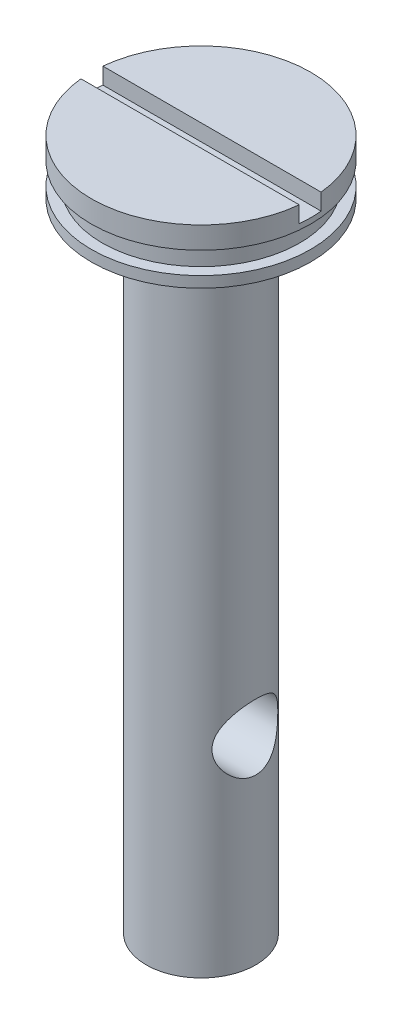
ISO-10303-21;
HEADER;
FILE_DESCRIPTION(('STEP AP214'),'2;1');
FILE_NAME('part.step','',(''),(''),'','','');
FILE_SCHEMA(('AUTOMOTIVE_DESIGN { 1 0 10303 214 1 1 1 1 }'));
ENDSEC;
DATA;
#1=APPLICATION_CONTEXT('core data for automotive mechanical design processes');
#2=APPLICATION_PROTOCOL_DEFINITION('international standard','automotive_design',2000,#1);
#3=PRODUCT_CONTEXT('',#1,'mechanical');
#4=PRODUCT('Part','Part','',(#3));
#5=PRODUCT_RELATED_PRODUCT_CATEGORY('part','',(#4));
#6=PRODUCT_DEFINITION_FORMATION('','',#4);
#7=PRODUCT_DEFINITION_CONTEXT('part definition',#1,'design');
#8=PRODUCT_DEFINITION('design','',#6,#7);
#9=PRODUCT_DEFINITION_SHAPE('','',#8);
#10=(LENGTH_UNIT() NAMED_UNIT(*) SI_UNIT(.MILLI.,.METRE.));
#11=(NAMED_UNIT(*) PLANE_ANGLE_UNIT() SI_UNIT($,.RADIAN.));
#12=(NAMED_UNIT(*) SI_UNIT($,.STERADIAN.) SOLID_ANGLE_UNIT());
#13=UNCERTAINTY_MEASURE_WITH_UNIT(LENGTH_MEASURE(1.E-05),#10,'distance_accuracy_value','');
#14=(GEOMETRIC_REPRESENTATION_CONTEXT(3) GLOBAL_UNCERTAINTY_ASSIGNED_CONTEXT((#13)) GLOBAL_UNIT_ASSIGNED_CONTEXT((#10,
#11,#12)) REPRESENTATION_CONTEXT('',''));
#15=CARTESIAN_POINT('',(0.,0.,0.));
#16=DIRECTION('',(0.,0.,1.));
#17=DIRECTION('',(1.,0.,0.));
#18=AXIS2_PLACEMENT_3D('',#15,#16,#17);
#19=CARTESIAN_POINT('',(0.,45.,-10.));
#20=DIRECTION('',(0.,-1.,0.));
#21=DIRECTION('',(0.,0.,-1.));
#22=AXIS2_PLACEMENT_3D('',#19,#20,#21);
#23=PLANE('',#22);
#24=CARTESIAN_POINT('',(0.,45.,0.));
#25=DIRECTION('',(0.,1.,0.));
#26=DIRECTION('',(0.,0.,1.));
#27=AXIS2_PLACEMENT_3D('',#24,#25,#26);
#28=CIRCLE('',#27,10.);
#29=CARTESIAN_POINT('',(-9.94987437106621,45.,1.));
#30=VERTEX_POINT('',#29);
#31=CARTESIAN_POINT('',(9.94987437106621,45.,1.));
#32=VERTEX_POINT('',#31);
#33=EDGE_CURVE('E101',#30,#32,#28,.T.);
#34=ORIENTED_EDGE('',*,*,#33,.T.);
#35=DIRECTION('',(-1.,0.,0.));
#36=VECTOR('',#35,1.);
#37=CARTESIAN_POINT('',(0.,45.,0.999999999999999));
#38=LINE('',#37,#36);
#39=EDGE_CURVE('E66',#32,#30,#38,.T.);
#40=ORIENTED_EDGE('',*,*,#39,.T.);
#41=EDGE_LOOP('',(#34,#40));
#42=FACE_BOUND('',#41,.T.);
#43=ADVANCED_FACE('F37',(#42),#23,.F.);
#44=CARTESIAN_POINT('',(0.,43.,-10.));
#45=DIRECTION('',(0.,1.,0.));
#46=DIRECTION('',(0.,0.,1.));
#47=AXIS2_PLACEMENT_3D('',#44,#45,#46);
#48=PLANE('',#47);
#49=CARTESIAN_POINT('',(0.,43.,0.));
#50=DIRECTION('',(0.,1.,0.));
#51=DIRECTION('',(0.,0.,1.));
#52=AXIS2_PLACEMENT_3D('',#49,#50,#51);
#53=CIRCLE('',#52,10.);
#54=CARTESIAN_POINT('',(0.,43.,10.));
#55=VERTEX_POINT('',#54);
#56=EDGE_CURVE('E90',#55,#55,#53,.T.);
#57=ORIENTED_EDGE('',*,*,#56,.F.);
#58=EDGE_LOOP('',(#57));
#59=FACE_BOUND('',#58,.T.);
#60=CARTESIAN_POINT('',(0.,43.,0.));
#61=DIRECTION('',(0.,1.,0.));
#62=DIRECTION('',(0.,0.,1.));
#63=AXIS2_PLACEMENT_3D('',#60,#61,#62);
#64=CIRCLE('',#63,9.00000000000003);
#65=CARTESIAN_POINT('',(0.,43.,9.00000000000004));
#66=VERTEX_POINT('',#65);
#67=EDGE_CURVE('E267',#66,#66,#64,.T.);
#68=ORIENTED_EDGE('',*,*,#67,.T.);
#69=EDGE_LOOP('',(#68));
#70=FACE_BOUND('',#69,.T.);
#71=ADVANCED_FACE('F39',(#59,#70),#48,.F.);
#72=CARTESIAN_POINT('',(0.,-18.,0.));
#73=DIRECTION('',(0.,1.,0.));
#74=DIRECTION('',(0.,0.,1.));
#75=AXIS2_PLACEMENT_3D('',#72,#73,#74);
#76=CYLINDRICAL_SURFACE('',#75,10.);
#77=CARTESIAN_POINT('',(9.94987437106621,45.,-0.999999999999999));
#78=VERTEX_POINT('',#77);
#79=CARTESIAN_POINT('',(-9.94987437106621,45.,-1.));
#80=VERTEX_POINT('',#79);
#81=EDGE_CURVE('E96',#78,#80,#28,.T.);
#82=ORIENTED_EDGE('',*,*,#81,.F.);
#83=DIRECTION('',(0.,1.,0.));
#84=VECTOR('',#83,1.);
#85=CARTESIAN_POINT('',(9.94987437106622,-18.,-1.00000000000001));
#86=LINE('',#85,#84);
#87=CARTESIAN_POINT('',(9.94987437106622,43.5,-1.));
#88=VERTEX_POINT('',#87);
#89=EDGE_CURVE('E58',#78,#88,#86,.F.);
#90=ORIENTED_EDGE('',*,*,#89,.T.);
#91=CARTESIAN_POINT('',(0.,43.5,0.));
#92=DIRECTION('',(0.,-1.,0.));
#93=DIRECTION('',(0.,0.,-1.));
#94=AXIS2_PLACEMENT_3D('',#91,#92,#93);
#95=CIRCLE('',#94,10.);
#96=CARTESIAN_POINT('',(9.94987437106622,43.5,1.));
#97=VERTEX_POINT('',#96);
#98=EDGE_CURVE('E111',#88,#97,#95,.T.);
#99=ORIENTED_EDGE('',*,*,#98,.T.);
#100=DIRECTION('',(0.,1.,0.));
#101=VECTOR('',#100,1.);
#102=CARTESIAN_POINT('',(9.94987437106622,-18.,1.00000000000001));
#103=LINE('',#102,#101);
#104=EDGE_CURVE('E270',#97,#32,#103,.T.);
#105=ORIENTED_EDGE('',*,*,#104,.T.);
#106=ORIENTED_EDGE('',*,*,#33,.F.);
#107=DIRECTION('',(0.,1.,0.));
#108=VECTOR('',#107,1.);
#109=CARTESIAN_POINT('',(-9.94987437106622,-18.,1.00000000000001));
#110=LINE('',#109,#108);
#111=CARTESIAN_POINT('',(-9.94987437106622,43.5,1.));
#112=VERTEX_POINT('',#111);
#113=EDGE_CURVE('E98',#30,#112,#110,.F.);
#114=ORIENTED_EDGE('',*,*,#113,.T.);
#115=CARTESIAN_POINT('',(-9.94987437106622,43.5,-1.));
#116=VERTEX_POINT('',#115);
#117=EDGE_CURVE('E51',#112,#116,#95,.T.);
#118=ORIENTED_EDGE('',*,*,#117,.T.);
#119=DIRECTION('',(0.,1.,0.));
#120=VECTOR('',#119,1.);
#121=CARTESIAN_POINT('',(-9.94987437106622,-18.,-1.00000000000001));
#122=LINE('',#121,#120);
#123=EDGE_CURVE('E85',#116,#80,#122,.T.);
#124=ORIENTED_EDGE('',*,*,#123,.T.);
#125=EDGE_LOOP('',(#82,#90,#99,#105,#106,#114,#118,#124));
#126=FACE_BOUND('',#125,.T.);
#127=ORIENTED_EDGE('',*,*,#56,.T.);
#128=EDGE_LOOP('',(#127));
#129=FACE_BOUND('',#128,.T.);
#130=ADVANCED_FACE('F94',(#126,#129),#76,.T.);
#131=ORIENTED_EDGE('',*,*,#81,.T.);
#132=DIRECTION('',(1.,0.,0.));
#133=VECTOR('',#132,1.);
#134=CARTESIAN_POINT('',(0.,45.,-0.999999999999999));
#135=LINE('',#134,#133);
#136=EDGE_CURVE('E82',#80,#78,#135,.T.);
#137=ORIENTED_EDGE('',*,*,#136,.T.);
#138=EDGE_LOOP('',(#131,#137));
#139=FACE_BOUND('',#138,.T.);
#140=ADVANCED_FACE('F100',(#139),#23,.F.);
#141=CARTESIAN_POINT('',(0.,-18.,0.));
#142=DIRECTION('',(0.,1.,0.));
#143=DIRECTION('',(0.,0.,1.));
#144=AXIS2_PLACEMENT_3D('',#141,#142,#143);
#145=PLANE('',#144);
#146=CARTESIAN_POINT('',(0.,-18.,0.));
#147=DIRECTION('',(0.,1.,0.));
#148=DIRECTION('',(0.,0.,1.));
#149=AXIS2_PLACEMENT_3D('',#146,#147,#148);
#150=CIRCLE('',#149,5.);
#151=CARTESIAN_POINT('',(0.,-18.,4.99999999999999));
#152=VERTEX_POINT('',#151);
#153=EDGE_CURVE('E106',#152,#152,#150,.T.);
#154=ORIENTED_EDGE('',*,*,#153,.F.);
#155=EDGE_LOOP('',(#154));
#156=FACE_BOUND('',#155,.T.);
#157=ADVANCED_FACE('F152',(#156),#145,.F.);
#158=CARTESIAN_POINT('',(0.,-18.,0.));
#159=DIRECTION('',(0.,1.,0.));
#160=DIRECTION('',(0.,0.,1.));
#161=AXIS2_PLACEMENT_3D('',#158,#159,#160);
#162=CYLINDRICAL_SURFACE('',#161,5.00000000000001);
#163=CARTESIAN_POINT('',(-4.00000000000001,0.,-3.));
#164=CARTESIAN_POINT('',(-3.99999997094659,0.0754616103656618,-2.9999999059924));
#165=CARTESIAN_POINT('',(-4.00214560778387,0.150919951825707,-2.99714660074499));
#166=CARTESIAN_POINT('',(-4.0106190584126,0.301183579155877,-2.98579602023829));
#167=CARTESIAN_POINT('',(-4.01694847458099,0.37598860368072,-2.97729658251829));
#168=CARTESIAN_POINT('',(-4.04185988554315,0.598542400800125,-2.94350195877));
#169=CARTESIAN_POINT('',(-4.06636523363868,0.744466163038649,-2.90991036792577));
#170=CARTESIAN_POINT('',(-4.12724466313281,1.02619529387303,-2.82286888064331));
#171=CARTESIAN_POINT('',(-4.16353284212728,1.16206540972156,-2.76956233581238));
#172=CARTESIAN_POINT('',(-4.24371857831164,1.42286717142596,-2.64505893939301));
#173=CARTESIAN_POINT('',(-4.28761840405595,1.54779553947816,-2.57385675138361));
#174=CARTESIAN_POINT('',(-4.38457211439751,1.79990131024536,-2.40542341931062));
#175=CARTESIAN_POINT('',(-4.43808896832274,1.92548608074574,-2.30607419983945));
#176=CARTESIAN_POINT('',(-4.54452303763809,2.15952535636891,-2.08854542159202));
#177=CARTESIAN_POINT('',(-4.5974397715576,2.26796690142325,-1.97035175093534));
#178=CARTESIAN_POINT('',(-4.7035179816543,2.47628246871424,-1.70284578042266));
#179=CARTESIAN_POINT('',(-4.75608869625049,2.57396641364106,-1.55155129309905));
#180=CARTESIAN_POINT('',(-4.82570563669469,2.69974650858797,-1.31132430439157));
#181=CARTESIAN_POINT('',(-4.84737661360988,2.73822411545811,-1.22900736782604));
#182=CARTESIAN_POINT('',(-4.8870100275605,2.80779096487914,-1.06047221299631));
#183=CARTESIAN_POINT('',(-4.90497491519087,2.83888509171157,-0.974256618946845));
#184=CARTESIAN_POINT('',(-4.93511193886541,2.89062746245329,-0.806968026671436));
#185=CARTESIAN_POINT('',(-4.94767216447127,2.9119872715291,-0.726184158740188));
#186=CARTESIAN_POINT('',(-4.96892323787742,2.94794996135096,-0.562666348744431));
#187=CARTESIAN_POINT('',(-4.97761624192488,2.9625566076376,-0.479933520527564));
#188=CARTESIAN_POINT('',(-4.99087754875313,2.98478468451609,-0.313244621267395));
#189=CARTESIAN_POINT('',(-4.99544805239182,2.9924098423118,-0.229289227265367));
#190=CARTESIAN_POINT('',(-5.00033941607429,3.00056663984718,-0.0609397888852066));
#191=CARTESIAN_POINT('',(-5.00066070848408,3.00109900129356,0.0234542099897582));
#192=CARTESIAN_POINT('',(-4.99565270087358,2.99275721772025,0.255171183646356));
#193=CARTESIAN_POINT('',(-4.98590479614143,2.97652885035085,0.402219957267168));
#194=CARTESIAN_POINT('',(-4.95416390550292,2.92304450631758,0.690956248818425));
#195=CARTESIAN_POINT('',(-4.93217001333341,2.88578697338949,0.832643369131342));
#196=CARTESIAN_POINT('',(-4.87769707511976,2.79166776699804,1.10810607069191));
#197=CARTESIAN_POINT('',(-4.84515792140776,2.73469357980007,1.2418309672266));
#198=CARTESIAN_POINT('',(-4.77219304045847,2.6032310655483,1.49797933560354));
#199=CARTESIAN_POINT('',(-4.73176526544936,2.52873818986414,1.62039986081242));
#200=CARTESIAN_POINT('',(-4.64075842839174,2.35432172038148,1.86614789799246));
#201=CARTESIAN_POINT('',(-4.58954363323804,2.25242335146449,1.98783715480756));
#202=CARTESIAN_POINT('',(-4.48511110796776,2.03119178989514,2.21342948923169));
#203=CARTESIAN_POINT('',(-4.43189074054161,1.91183500028094,2.31730807434112));
#204=CARTESIAN_POINT('',(-4.3222214952534,1.64269317960225,2.51649670159325));
#205=CARTESIAN_POINT('',(-4.26611322583748,1.4909848446704,2.60941864927586));
#206=CARTESIAN_POINT('',(-4.16501759300693,1.17058753897333,2.76794435835451));
#207=CARTESIAN_POINT('',(-4.12000980621704,1.00193056868575,2.83359844351372));
#208=CARTESIAN_POINT('',(-4.05791730375362,0.695212735504367,2.92154993808435));
#209=CARTESIAN_POINT('',(-4.0366777727856,0.559918734207663,2.95055806318484));
#210=CARTESIAN_POINT('',(-4.00784301513239,0.285252780598733,2.98961745817055));
#211=CARTESIAN_POINT('',(-4.00023192044757,0.145885763115489,2.99969077510549));
#212=CARTESIAN_POINT('',(-3.99977828828381,-0.133103368961641,3.00029561322377));
#213=CARTESIAN_POINT('',(-4.00695621149425,-0.272725569601723,2.99080006076192));
#214=CARTESIAN_POINT('',(-4.03503040875295,-0.547974672313776,2.95280584471632));
#215=CARTESIAN_POINT('',(-4.05593752603306,-0.683598327819912,2.92429216045109));
#216=CARTESIAN_POINT('',(-4.10863539286052,-0.947429215549482,2.84976612867927));
#217=CARTESIAN_POINT('',(-4.14041253958233,-1.07564548413755,2.8037756438149));
#218=CARTESIAN_POINT('',(-4.21143069058875,-1.32295522030752,2.69592568264801));
#219=CARTESIAN_POINT('',(-4.25067450889247,-1.44204522459391,2.63406022035171));
#220=CARTESIAN_POINT('',(-4.34073681424695,-1.69048109524631,2.48334675803861));
#221=CARTESIAN_POINT('',(-4.3923665298154,-1.81780543232945,2.39164503852699));
#222=CARTESIAN_POINT('',(-4.49643335252965,-2.05656720394542,2.1897561409589));
#223=CARTESIAN_POINT('',(-4.54887118822614,-2.16798924609445,2.0795512745713));
#224=CARTESIAN_POINT('',(-4.65671991538656,-2.38646399131575,1.82651475528322));
#225=CARTESIAN_POINT('',(-4.71163080343123,-2.49106470576289,1.68130397020027));
#226=CARTESIAN_POINT('',(-4.78599458202113,-2.6281544977234,1.4494463127851));
#227=CARTESIAN_POINT('',(-4.80945640676868,-2.67056200213692,1.36978605711652));
#228=CARTESIAN_POINT('',(-4.85305400686527,-2.74830388347849,1.20623656162323));
#229=CARTESIAN_POINT('',(-4.8731918746406,-2.7836427131187,1.12235002598573));
#230=CARTESIAN_POINT('',(-4.90820667253682,-2.84447964323443,0.957140698774926));
#231=CARTESIAN_POINT('',(-4.92335831278732,-2.87050371846179,0.876069467337975));
#232=CARTESIAN_POINT('',(-4.94982497459133,-2.91566498160908,0.711460619981294));
#233=CARTESIAN_POINT('',(-4.9611421459459,-2.93480602887991,0.627924414708822));
#234=CARTESIAN_POINT('',(-4.97959903931251,-2.9659003097131,0.45911961508227));
#235=CARTESIAN_POINT('',(-4.98674160560363,-2.97785843736055,0.373852241304036));
#236=CARTESIAN_POINT('',(-4.99664216975595,-2.99440676165901,0.202384159163463));
#237=CARTESIAN_POINT('',(-4.99940073918633,-2.99899791878895,0.116183573945408));
#238=CARTESIAN_POINT('',(-5.00079353601934,-3.0013282897594,-0.11951938408059));
#239=CARTESIAN_POINT('',(-4.99493619757571,-2.9916010745741,-0.269213134971596));
#240=CARTESIAN_POINT('',(-4.97026391444785,-2.95021794585105,-0.564325544477565));
#241=CARTESIAN_POINT('',(-4.95144882543497,-2.91856178805991,-0.70974415545549));
#242=CARTESIAN_POINT('',(-4.90298726022977,-2.83555942935371,-0.990283617430286));
#243=CARTESIAN_POINT('',(-4.87351900635897,-2.784536560451,-1.12553205648681));
#244=CARTESIAN_POINT('',(-4.80606707983651,-2.66471905823651,-1.38556595318152));
#245=CARTESIAN_POINT('',(-4.76808149787885,-2.59592043965643,-1.51034905620297));
#246=CARTESIAN_POINT('',(-4.68186861678972,-2.43415009310424,-1.76052652812015));
#247=CARTESIAN_POINT('',(-4.63297714592577,-2.33936493647195,-1.88451663454097));
#248=CARTESIAN_POINT('',(-4.5320378935883,-2.1324915754345,-2.1157957778969));
#249=CARTESIAN_POINT('',(-4.47998665474643,-2.0203842023356,-2.22306604531464));
#250=CARTESIAN_POINT('',(-4.37056449731608,-1.76543895662125,-2.43181699852644));
#251=CARTESIAN_POINT('',(-4.31335603990194,-1.62050691551089,-2.53083841179815));
#252=CARTESIAN_POINT('',(-4.20752457767504,-1.31299042740472,-2.70314606061126));
#253=CARTESIAN_POINT('',(-4.15889711577768,-1.15041521580195,-2.77644567607669));
#254=CARTESIAN_POINT('',(-4.10004730463766,-0.903377447312356,-2.8619348491458));
#255=CARTESIAN_POINT('',(-4.08329508678221,-0.824341408702765,-2.88571236613333));
#256=CARTESIAN_POINT('',(-4.0539508765597,-0.663869558199829,-2.92679381745552));
#257=CARTESIAN_POINT('',(-4.04135625254713,-0.582435300012672,-2.94410184772356));
#258=CARTESIAN_POINT('',(-4.02094972226271,-0.417953449305939,-2.97191221271433));
#259=CARTESIAN_POINT('',(-4.0131302337705,-0.334908631628274,-2.98242533831514));
#260=CARTESIAN_POINT('',(-4.00265571377828,-0.167907783336384,-2.99646884485439));
#261=CARTESIAN_POINT('',(-4.00000003232226,-0.0839518687375932,-3.00000010458449));
#262=CARTESIAN_POINT('',(-4.00000000000001,0.,-3.));
#263=B_SPLINE_CURVE_WITH_KNOTS('',3,(#163,#164,#165,#166,#167,#168,#169,#170,#171,#172,#173,
#174,#175,#176,#177,#178,#179,#180,#181,#182,#183,#184,#185,#186,#187,#188,#189,#190,#191,#192,
#193,#194,#195,#196,#197,#198,#199,#200,#201,#202,#203,#204,#205,#206,#207,#208,#209,#210,#211,
#212,#213,#214,#215,#216,#217,#218,#219,#220,#221,#222,#223,#224,#225,#226,#227,#228,#229,#230,
#231,#232,#233,#234,#235,#236,#237,#238,#239,#240,#241,#242,#243,#244,#245,#246,#247,#248,#249,
#250,#251,#252,#253,#254,#255,#256,#257,#258,#259,#260,#261,#262),.UNSPECIFIED.,.T.,.F.,(4,2,2,
2,2,2,2,2,2,2,2,2,2,2,2,2,2,2,2,2,2,2,2,2,2,2,2,2,2,2,2,2,2,2,2,2,2,2,2,2,2,2,2,2,2,2,2,2,2,4),
(0.,0.226288173517879,0.452663065091107,0.905305714765856,1.35471981612576,1.80426809059901,
2.30878181396805,2.81367513819685,3.37309572088444,3.65297634398311,3.93267130287329,
4.18580566749444,4.43879871451846,4.6916566173785,4.94448879122708,5.38694235003539,
5.82942865693064,6.27448283989929,6.71965270654932,7.21799594026829,7.71701907227943,
8.27387316194678,8.82969494223662,9.24786570023494,9.66554925202079,10.0838110593649,
10.5024036052238,10.9204742264512,11.3387027222345,11.8323285087813,12.3264288987103,
12.884776299373,13.1641700331408,13.4433872125907,13.7024631857776,13.9613936663243,
14.2201475237758,14.4788676430947,14.9267946196281,15.3747265854331,15.8154875864153,
16.2563474905318,16.7450674536299,17.2343321574792,17.7856420979722,18.3366648323362,
18.5890061072372,18.8411873492279,19.0929671157917,19.3447151893881),.UNSPECIFIED.);
#264=CARTESIAN_POINT('',(-4.00000000000001,0.,-3.));
#265=VERTEX_POINT('',#264);
#266=EDGE_CURVE('E41',#265,#265,#263,.T.);
#267=ORIENTED_EDGE('',*,*,#266,.T.);
#268=EDGE_LOOP('',(#267));
#269=FACE_BOUND('',#268,.T.);
#270=CARTESIAN_POINT('',(4.00000000000002,0.,-3.));
#271=CARTESIAN_POINT('',(3.9999999709466,-0.0754616103656618,-2.99999990599239));
#272=CARTESIAN_POINT('',(4.00214560778387,-0.150919951825707,-2.99714660074499));
#273=CARTESIAN_POINT('',(4.0106190584126,-0.301183579155877,-2.98579602023829));
#274=CARTESIAN_POINT('',(4.01694847458099,-0.37598860368072,-2.97729658251829));
#275=CARTESIAN_POINT('',(4.04185988554315,-0.598542400800125,-2.94350195877));
#276=CARTESIAN_POINT('',(4.06636523363868,-0.744466163038649,-2.90991036792576));
#277=CARTESIAN_POINT('',(4.12724466313281,-1.02619529387303,-2.82286888064331));
#278=CARTESIAN_POINT('',(4.16353284212728,-1.16206540972156,-2.76956233581238));
#279=CARTESIAN_POINT('',(4.24371857831164,-1.42286717142596,-2.645058939393));
#280=CARTESIAN_POINT('',(4.28761840405595,-1.54779553947816,-2.5738567513836));
#281=CARTESIAN_POINT('',(4.38457211439752,-1.79990131024536,-2.40542341931062));
#282=CARTESIAN_POINT('',(4.43808896832274,-1.92548608074574,-2.30607419983945));
#283=CARTESIAN_POINT('',(4.54452303763809,-2.15952535636891,-2.08854542159202));
#284=CARTESIAN_POINT('',(4.5974397715576,-2.26796690142325,-1.97035175093534));
#285=CARTESIAN_POINT('',(4.7035179816543,-2.47628246871424,-1.70284578042266));
#286=CARTESIAN_POINT('',(4.75608869625049,-2.57396641364106,-1.55155129309905));
#287=CARTESIAN_POINT('',(4.82570563669469,-2.69974650858797,-1.31132430439156));
#288=CARTESIAN_POINT('',(4.84737661360988,-2.73822411545811,-1.22900736782604));
#289=CARTESIAN_POINT('',(4.8870100275605,-2.80779096487914,-1.06047221299631));
#290=CARTESIAN_POINT('',(4.90497491519087,-2.83888509171157,-0.974256618946842));
#291=CARTESIAN_POINT('',(4.93511193886541,-2.89062746245329,-0.806968026671433));
#292=CARTESIAN_POINT('',(4.94767216447127,-2.9119872715291,-0.726184158740185));
#293=CARTESIAN_POINT('',(4.96892323787742,-2.94794996135096,-0.562666348744428));
#294=CARTESIAN_POINT('',(4.97761624192488,-2.9625566076376,-0.479933520527561));
#295=CARTESIAN_POINT('',(4.99087754875313,-2.98478468451609,-0.313244621267392));
#296=CARTESIAN_POINT('',(4.99544805239182,-2.9924098423118,-0.229289227265364));
#297=CARTESIAN_POINT('',(5.00033941607429,-3.00056663984718,-0.0609397888852031));
#298=CARTESIAN_POINT('',(5.00066070848408,-3.00109900129356,0.0234542099897616));
#299=CARTESIAN_POINT('',(4.99565270087358,-2.99275721772025,0.25517118364636));
#300=CARTESIAN_POINT('',(4.98590479614143,-2.97652885035085,0.402219957267171));
#301=CARTESIAN_POINT('',(4.95416390550292,-2.92304450631758,0.690956248818428));
#302=CARTESIAN_POINT('',(4.93217001333341,-2.88578697338949,0.832643369131345));
#303=CARTESIAN_POINT('',(4.87769707511975,-2.79166776699804,1.10810607069191));
#304=CARTESIAN_POINT('',(4.84515792140776,-2.73469357980007,1.24183096722661));
#305=CARTESIAN_POINT('',(4.77219304045847,-2.6032310655483,1.49797933560354));
#306=CARTESIAN_POINT('',(4.73176526544936,-2.52873818986414,1.62039986081242));
#307=CARTESIAN_POINT('',(4.64075842839174,-2.35432172038148,1.86614789799246));
#308=CARTESIAN_POINT('',(4.58954363323804,-2.25242335146449,1.98783715480757));
#309=CARTESIAN_POINT('',(4.48511110796775,-2.03119178989514,2.2134294892317));
#310=CARTESIAN_POINT('',(4.43189074054161,-1.91183500028094,2.31730807434112));
#311=CARTESIAN_POINT('',(4.3222214952534,-1.64269317960225,2.51649670159325));
#312=CARTESIAN_POINT('',(4.26611322583747,-1.4909848446704,2.60941864927586));
#313=CARTESIAN_POINT('',(4.16501759300693,-1.17058753897333,2.76794435835452));
#314=CARTESIAN_POINT('',(4.12000980621703,-1.00193056868575,2.83359844351372));
#315=CARTESIAN_POINT('',(4.05791730375362,-0.695212735504366,2.92154993808435));
#316=CARTESIAN_POINT('',(4.0366777727856,-0.559918734207663,2.95055806318484));
#317=CARTESIAN_POINT('',(4.00784301513239,-0.285252780598733,2.98961745817055));
#318=CARTESIAN_POINT('',(4.00023192044757,-0.145885763115488,2.99969077510549));
#319=CARTESIAN_POINT('',(3.99977828828381,0.133103368961642,3.00029561322377));
#320=CARTESIAN_POINT('',(4.00695621149424,0.272725569601724,2.99080006076192));
#321=CARTESIAN_POINT('',(4.03503040875295,0.547974672313777,2.95280584471632));
#322=CARTESIAN_POINT('',(4.05593752603306,0.683598327819913,2.92429216045109));
#323=CARTESIAN_POINT('',(4.10863539286052,0.947429215549483,2.84976612867927));
#324=CARTESIAN_POINT('',(4.14041253958233,1.07564548413756,2.8037756438149));
#325=CARTESIAN_POINT('',(4.21143069058875,1.32295522030753,2.69592568264801));
#326=CARTESIAN_POINT('',(4.25067450889247,1.44204522459391,2.63406022035171));
#327=CARTESIAN_POINT('',(4.34073681424695,1.69048109524631,2.48334675803861));
#328=CARTESIAN_POINT('',(4.3923665298154,1.81780543232945,2.39164503852699));
#329=CARTESIAN_POINT('',(4.49643335252965,2.05656720394542,2.1897561409589));
#330=CARTESIAN_POINT('',(4.54887118822614,2.16798924609445,2.0795512745713));
#331=CARTESIAN_POINT('',(4.65671991538656,2.38646399131575,1.82651475528322));
#332=CARTESIAN_POINT('',(4.71163080343123,2.49106470576289,1.68130397020028));
#333=CARTESIAN_POINT('',(4.78599458202113,2.6281544977234,1.44944631278511));
#334=CARTESIAN_POINT('',(4.80945640676868,2.67056200213692,1.36978605711652));
#335=CARTESIAN_POINT('',(4.85305400686528,2.74830388347849,1.20623656162324));
#336=CARTESIAN_POINT('',(4.8731918746406,2.7836427131187,1.12235002598573));
#337=CARTESIAN_POINT('',(4.90820667253682,2.84447964323443,0.957140698774929));
#338=CARTESIAN_POINT('',(4.92335831278732,2.87050371846179,0.876069467337978));
#339=CARTESIAN_POINT('',(4.94982497459133,2.91566498160908,0.711460619981297));
#340=CARTESIAN_POINT('',(4.9611421459459,2.93480602887991,0.627924414708825));
#341=CARTESIAN_POINT('',(4.97959903931251,2.9659003097131,0.459119615082273));
#342=CARTESIAN_POINT('',(4.98674160560363,2.97785843736055,0.373852241304039));
#343=CARTESIAN_POINT('',(4.99664216975595,2.99440676165901,0.202384159163466));
#344=CARTESIAN_POINT('',(4.99940073918633,2.99899791878895,0.116183573945411));
#345=CARTESIAN_POINT('',(5.00079353601934,3.0013282897594,-0.119519384080588));
#346=CARTESIAN_POINT('',(4.99493619757571,2.9916010745741,-0.269213134971593));
#347=CARTESIAN_POINT('',(4.97026391444785,2.95021794585105,-0.564325544477563));
#348=CARTESIAN_POINT('',(4.95144882543497,2.91856178805991,-0.709744155455487));
#349=CARTESIAN_POINT('',(4.90298726022977,2.83555942935371,-0.990283617430284));
#350=CARTESIAN_POINT('',(4.87351900635897,2.784536560451,-1.12553205648681));
#351=CARTESIAN_POINT('',(4.80606707983651,2.66471905823651,-1.38556595318152));
#352=CARTESIAN_POINT('',(4.76808149787885,2.59592043965643,-1.51034905620296));
#353=CARTESIAN_POINT('',(4.68186861678972,2.43415009310424,-1.76052652812015));
#354=CARTESIAN_POINT('',(4.63297714592577,2.33936493647194,-1.88451663454097));
#355=CARTESIAN_POINT('',(4.53203789358831,2.1324915754345,-2.1157957778969));
#356=CARTESIAN_POINT('',(4.47998665474643,2.0203842023356,-2.22306604531464));
#357=CARTESIAN_POINT('',(4.37056449731608,1.76543895662125,-2.43181699852643));
#358=CARTESIAN_POINT('',(4.31335603990195,1.62050691551089,-2.53083841179815));
#359=CARTESIAN_POINT('',(4.20752457767504,1.31299042740472,-2.70314606061126));
#360=CARTESIAN_POINT('',(4.15889711577768,1.15041521580195,-2.77644567607669));
#361=CARTESIAN_POINT('',(4.10004730463766,0.903377447312357,-2.86193484914579));
#362=CARTESIAN_POINT('',(4.08329508678221,0.824341408702765,-2.88571236613332));
#363=CARTESIAN_POINT('',(4.0539508765597,0.663869558199829,-2.92679381745552));
#364=CARTESIAN_POINT('',(4.04135625254713,0.582435300012671,-2.94410184772356));
#365=CARTESIAN_POINT('',(4.02094972226271,0.417953449305939,-2.97191221271433));
#366=CARTESIAN_POINT('',(4.0131302337705,0.334908631628274,-2.98242533831514));
#367=CARTESIAN_POINT('',(4.00265571377828,0.167907783336384,-2.99646884485439));
#368=CARTESIAN_POINT('',(4.00000003232226,0.0839518687375932,-3.00000010458449));
#369=CARTESIAN_POINT('',(4.00000000000002,0.,-3.));
#370=B_SPLINE_CURVE_WITH_KNOTS('',3,(#270,#271,#272,#273,#274,#275,#276,#277,#278,#279,#280,
#281,#282,#283,#284,#285,#286,#287,#288,#289,#290,#291,#292,#293,#294,#295,#296,#297,#298,#299,
#300,#301,#302,#303,#304,#305,#306,#307,#308,#309,#310,#311,#312,#313,#314,#315,#316,#317,#318,
#319,#320,#321,#322,#323,#324,#325,#326,#327,#328,#329,#330,#331,#332,#333,#334,#335,#336,#337,
#338,#339,#340,#341,#342,#343,#344,#345,#346,#347,#348,#349,#350,#351,#352,#353,#354,#355,#356,
#357,#358,#359,#360,#361,#362,#363,#364,#365,#366,#367,#368,#369),.UNSPECIFIED.,.T.,.F.,(4,2,2,
2,2,2,2,2,2,2,2,2,2,2,2,2,2,2,2,2,2,2,2,2,2,2,2,2,2,2,2,2,2,2,2,2,2,2,2,2,2,2,2,2,2,2,2,2,2,4),
(0.,0.226288173517879,0.452663065091107,0.905305714765857,1.35471981612576,1.80426809059901,
2.30878181396805,2.81367513819685,3.37309572088444,3.65297634398311,3.93267130287329,
4.18580566749444,4.43879871451846,4.6916566173785,4.94448879122708,5.38694235003539,
5.82942865693064,6.27448283989929,6.71965270654932,7.21799594026829,7.71701907227943,
8.27387316194678,8.82969494223662,9.24786570023494,9.66554925202079,10.0838110593649,
10.5024036052238,10.9204742264512,11.3387027222345,11.8323285087813,12.3264288987103,
12.884776299373,13.1641700331408,13.4433872125907,13.7024631857776,13.9613936663243,
14.2201475237758,14.4788676430947,14.9267946196281,15.3747265854331,15.8154875864153,
16.2563474905318,16.7450674536299,17.2343321574792,17.7856420979722,18.3366648323362,
18.5890061072372,18.8411873492279,19.0929671157917,19.3447151893882),.UNSPECIFIED.);
#371=CARTESIAN_POINT('',(4.00000000000002,0.,-3.));
#372=VERTEX_POINT('',#371);
#373=EDGE_CURVE('E11',#372,#372,#370,.T.);
#374=ORIENTED_EDGE('',*,*,#373,.T.);
#375=EDGE_LOOP('',(#374));
#376=FACE_BOUND('',#375,.T.);
#377=CARTESIAN_POINT('',(0.,40.,0.));
#378=DIRECTION('',(0.,1.,0.));
#379=DIRECTION('',(0.,0.,1.));
#380=AXIS2_PLACEMENT_3D('',#377,#378,#379);
#381=CIRCLE('',#380,5.00000000000002);
#382=CARTESIAN_POINT('',(0.,40.,5.00000000000003));
#383=VERTEX_POINT('',#382);
#384=EDGE_CURVE('E254',#383,#383,#381,.T.);
#385=ORIENTED_EDGE('',*,*,#384,.F.);
#386=EDGE_LOOP('',(#385));
#387=FACE_BOUND('',#386,.T.);
#388=ORIENTED_EDGE('',*,*,#153,.T.);
#389=EDGE_LOOP('',(#388));
#390=FACE_BOUND('',#389,.T.);
#391=ADVANCED_FACE('F116',(#269,#376,#387,#390),#162,.T.);
#392=CARTESIAN_POINT('',(0.,40.,-5.00000000000001));
#393=DIRECTION('',(0.,1.,0.));
#394=DIRECTION('',(0.,0.,1.));
#395=AXIS2_PLACEMENT_3D('',#392,#393,#394);
#396=PLANE('',#395);
#397=CARTESIAN_POINT('',(0.,40.,0.));
#398=DIRECTION('',(0.,1.,0.));
#399=DIRECTION('',(0.,0.,1.));
#400=AXIS2_PLACEMENT_3D('',#397,#398,#399);
#401=CIRCLE('',#400,10.);
#402=CARTESIAN_POINT('',(0.,40.,10.));
#403=VERTEX_POINT('',#402);
#404=EDGE_CURVE('E256',#403,#403,#401,.T.);
#405=ORIENTED_EDGE('',*,*,#404,.F.);
#406=EDGE_LOOP('',(#405));
#407=FACE_BOUND('',#406,.T.);
#408=ORIENTED_EDGE('',*,*,#384,.T.);
#409=EDGE_LOOP('',(#408));
#410=FACE_BOUND('',#409,.T.);
#411=ADVANCED_FACE('F145',(#407,#410),#396,.F.);
#412=CARTESIAN_POINT('',(0.,-18.,0.));
#413=DIRECTION('',(0.,1.,0.));
#414=DIRECTION('',(0.,0.,1.));
#415=AXIS2_PLACEMENT_3D('',#412,#413,#414);
#416=CYLINDRICAL_SURFACE('',#415,10.);
#417=CARTESIAN_POINT('',(0.,41.,0.));
#418=DIRECTION('',(0.,1.,0.));
#419=DIRECTION('',(0.,0.,1.));
#420=AXIS2_PLACEMENT_3D('',#417,#418,#419);
#421=CIRCLE('',#420,10.);
#422=CARTESIAN_POINT('',(0.,41.,10.));
#423=VERTEX_POINT('',#422);
#424=EDGE_CURVE('E259',#423,#423,#421,.T.);
#425=ORIENTED_EDGE('',*,*,#424,.F.);
#426=EDGE_LOOP('',(#425));
#427=FACE_BOUND('',#426,.T.);
#428=ORIENTED_EDGE('',*,*,#404,.T.);
#429=EDGE_LOOP('',(#428));
#430=FACE_BOUND('',#429,.T.);
#431=ADVANCED_FACE('F142',(#427,#430),#416,.T.);
#432=CARTESIAN_POINT('',(0.,41.,-10.));
#433=DIRECTION('',(0.,-1.,0.));
#434=DIRECTION('',(0.,0.,-1.));
#435=AXIS2_PLACEMENT_3D('',#432,#433,#434);
#436=PLANE('',#435);
#437=CARTESIAN_POINT('',(0.,41.,0.));
#438=DIRECTION('',(0.,1.,0.));
#439=DIRECTION('',(0.,0.,1.));
#440=AXIS2_PLACEMENT_3D('',#437,#438,#439);
#441=CIRCLE('',#440,9.00000000000003);
#442=CARTESIAN_POINT('',(0.,41.,9.00000000000004));
#443=VERTEX_POINT('',#442);
#444=EDGE_CURVE('E264',#443,#443,#441,.T.);
#445=ORIENTED_EDGE('',*,*,#444,.F.);
#446=EDGE_LOOP('',(#445));
#447=FACE_BOUND('',#446,.T.);
#448=ORIENTED_EDGE('',*,*,#424,.T.);
#449=EDGE_LOOP('',(#448));
#450=FACE_BOUND('',#449,.T.);
#451=ADVANCED_FACE('F138',(#447,#450),#436,.F.);
#452=CARTESIAN_POINT('',(0.,-18.,0.));
#453=DIRECTION('',(0.,1.,0.));
#454=DIRECTION('',(0.,0.,1.));
#455=AXIS2_PLACEMENT_3D('',#452,#453,#454);
#456=CYLINDRICAL_SURFACE('',#455,9.00000000000003);
#457=ORIENTED_EDGE('',*,*,#67,.F.);
#458=EDGE_LOOP('',(#457));
#459=FACE_BOUND('',#458,.T.);
#460=ORIENTED_EDGE('',*,*,#444,.T.);
#461=EDGE_LOOP('',(#460));
#462=FACE_BOUND('',#461,.T.);
#463=ADVANCED_FACE('F132',(#459,#462),#456,.T.);
#464=CARTESIAN_POINT('',(-10.,43.5,1.));
#465=DIRECTION('',(0.,-1.,0.));
#466=DIRECTION('',(0.,0.,-1.));
#467=AXIS2_PLACEMENT_3D('',#464,#465,#466);
#468=PLANE('',#467);
#469=DIRECTION('',(1.,0.,0.));
#470=VECTOR('',#469,1.);
#471=CARTESIAN_POINT('',(-10.,43.5,-1.));
#472=LINE('',#471,#470);
#473=EDGE_CURVE('E274',#116,#88,#472,.T.);
#474=ORIENTED_EDGE('',*,*,#473,.F.);
#475=ORIENTED_EDGE('',*,*,#117,.F.);
#476=DIRECTION('',(1.,0.,0.));
#477=VECTOR('',#476,1.);
#478=CARTESIAN_POINT('',(-10.,43.5,1.));
#479=LINE('',#478,#477);
#480=EDGE_CURVE('E275',#112,#97,#479,.T.);
#481=ORIENTED_EDGE('',*,*,#480,.T.);
#482=ORIENTED_EDGE('',*,*,#98,.F.);
#483=EDGE_LOOP('',(#474,#475,#481,#482));
#484=FACE_BOUND('',#483,.T.);
#485=ADVANCED_FACE('F129',(#484),#468,.F.);
#486=CARTESIAN_POINT('',(-10.,45.,1.));
#487=DIRECTION('',(0.,0.,1.));
#488=DIRECTION('',(0.,-1.,0.));
#489=AXIS2_PLACEMENT_3D('',#486,#487,#488);
#490=PLANE('',#489);
#491=ORIENTED_EDGE('',*,*,#480,.F.);
#492=ORIENTED_EDGE('',*,*,#113,.F.);
#493=ORIENTED_EDGE('',*,*,#39,.F.);
#494=ORIENTED_EDGE('',*,*,#104,.F.);
#495=EDGE_LOOP('',(#491,#492,#493,#494));
#496=FACE_BOUND('',#495,.T.);
#497=ADVANCED_FACE('F128',(#496),#490,.F.);
#498=CARTESIAN_POINT('',(-10.,45.,-1.));
#499=DIRECTION('',(0.,0.,-1.));
#500=DIRECTION('',(0.,1.,0.));
#501=AXIS2_PLACEMENT_3D('',#498,#499,#500);
#502=PLANE('',#501);
#503=ORIENTED_EDGE('',*,*,#473,.T.);
#504=ORIENTED_EDGE('',*,*,#89,.F.);
#505=ORIENTED_EDGE('',*,*,#136,.F.);
#506=ORIENTED_EDGE('',*,*,#123,.F.);
#507=EDGE_LOOP('',(#503,#504,#505,#506));
#508=FACE_BOUND('',#507,.T.);
#509=ADVANCED_FACE('F84',(#508),#502,.F.);
#510=CARTESIAN_POINT('',(5.00000000000001,0.,0.));
#511=DIRECTION('',(1.,0.,0.));
#512=DIRECTION('',(0.,0.,-1.));
#513=AXIS2_PLACEMENT_3D('',#510,#511,#512);
#514=CYLINDRICAL_SURFACE('',#513,3.);
#515=ORIENTED_EDGE('',*,*,#373,.F.);
#516=EDGE_LOOP('',(#515));
#517=FACE_BOUND('',#516,.T.);
#518=ORIENTED_EDGE('',*,*,#266,.F.);
#519=EDGE_LOOP('',(#518));
#520=FACE_BOUND('',#519,.T.);
#521=ADVANCED_FACE('F120',(#517,#520),#514,.F.);
#522=CLOSED_SHELL('',(#43,#71,#130,#140,#157,#391,#411,#431,#451,#463,#485,#497,#509,#521));
#523=MANIFOLD_SOLID_BREP('B2',#522);
#524=ADVANCED_BREP_SHAPE_REPRESENTATION('',(#18,#523),#14);
#525=SHAPE_DEFINITION_REPRESENTATION(#9,#524);
ENDSEC;
END-ISO-10303-21;
